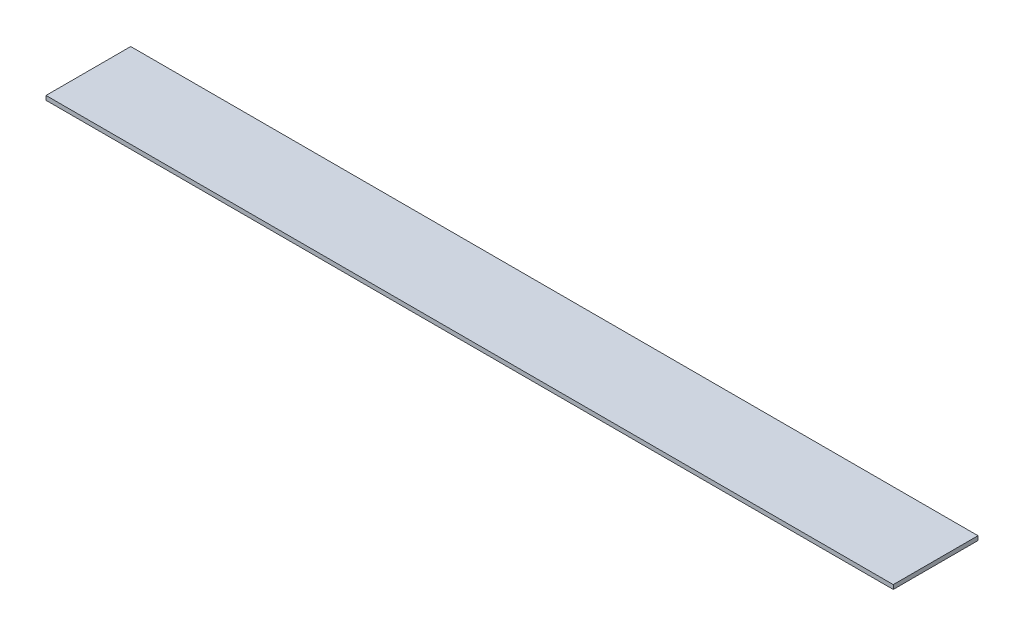
ISO-10303-21;
HEADER;
FILE_DESCRIPTION(('STEP AP214'),'2;1');
FILE_NAME('part.step','',(''),(''),'','','');
FILE_SCHEMA(('AUTOMOTIVE_DESIGN { 1 0 10303 214 1 1 1 1 }'));
ENDSEC;
DATA;
#1=APPLICATION_CONTEXT('core data for automotive mechanical design processes');
#2=APPLICATION_PROTOCOL_DEFINITION('international standard','automotive_design',2000,#1);
#3=PRODUCT_CONTEXT('',#1,'mechanical');
#4=PRODUCT('Part','Part','',(#3));
#5=PRODUCT_RELATED_PRODUCT_CATEGORY('part','',(#4));
#6=PRODUCT_DEFINITION_FORMATION('','',#4);
#7=PRODUCT_DEFINITION_CONTEXT('part definition',#1,'design');
#8=PRODUCT_DEFINITION('design','',#6,#7);
#9=PRODUCT_DEFINITION_SHAPE('','',#8);
#10=(LENGTH_UNIT() NAMED_UNIT(*) SI_UNIT(.MILLI.,.METRE.));
#11=(NAMED_UNIT(*) PLANE_ANGLE_UNIT() SI_UNIT($,.RADIAN.));
#12=(NAMED_UNIT(*) SI_UNIT($,.STERADIAN.) SOLID_ANGLE_UNIT());
#13=UNCERTAINTY_MEASURE_WITH_UNIT(LENGTH_MEASURE(1.E-05),#10,'distance_accuracy_value','');
#14=(GEOMETRIC_REPRESENTATION_CONTEXT(3) GLOBAL_UNCERTAINTY_ASSIGNED_CONTEXT((#13)) GLOBAL_UNIT_ASSIGNED_CONTEXT((#10,
#11,#12)) REPRESENTATION_CONTEXT('',''));
#15=CARTESIAN_POINT('',(0.,0.,0.));
#16=DIRECTION('',(0.,0.,1.));
#17=DIRECTION('',(1.,0.,0.));
#18=AXIS2_PLACEMENT_3D('',#15,#16,#17);
#19=CARTESIAN_POINT('',(999.999999999999,10.,-100.));
#20=DIRECTION('',(-1.,0.,0.));
#21=DIRECTION('',(0.,0.,1.));
#22=AXIS2_PLACEMENT_3D('',#19,#20,#21);
#23=PLANE('',#22);
#24=DIRECTION('',(0.,0.,-1.));
#25=VECTOR('',#24,1.);
#26=CARTESIAN_POINT('',(999.999999999999,0.,-100.));
#27=LINE('',#26,#25);
#28=CARTESIAN_POINT('',(999.999999999999,0.,100.));
#29=VERTEX_POINT('',#28);
#30=CARTESIAN_POINT('',(999.999999999999,0.,-100.));
#31=VERTEX_POINT('',#30);
#32=EDGE_CURVE('E97',#29,#31,#27,.T.);
#33=ORIENTED_EDGE('',*,*,#32,.T.);
#34=DIRECTION('',(0.,-1.,0.));
#35=VECTOR('',#34,1.);
#36=CARTESIAN_POINT('',(999.999999999999,10.,-100.));
#37=LINE('',#36,#35);
#38=CARTESIAN_POINT('',(999.999999999999,10.,-100.));
#39=VERTEX_POINT('',#38);
#40=EDGE_CURVE('E11',#39,#31,#37,.T.);
#41=ORIENTED_EDGE('',*,*,#40,.F.);
#42=DIRECTION('',(0.,0.,-1.));
#43=VECTOR('',#42,1.);
#44=CARTESIAN_POINT('',(999.999999999999,10.,-100.));
#45=LINE('',#44,#43);
#46=CARTESIAN_POINT('',(999.999999999999,10.,100.));
#47=VERTEX_POINT('',#46);
#48=EDGE_CURVE('E85',#47,#39,#45,.T.);
#49=ORIENTED_EDGE('',*,*,#48,.F.);
#50=DIRECTION('',(0.,-1.,0.));
#51=VECTOR('',#50,1.);
#52=CARTESIAN_POINT('',(999.999999999999,10.,100.));
#53=LINE('',#52,#51);
#54=EDGE_CURVE('E93',#47,#29,#53,.T.);
#55=ORIENTED_EDGE('',*,*,#54,.T.);
#56=EDGE_LOOP('',(#33,#41,#49,#55));
#57=FACE_BOUND('',#56,.T.);
#58=ADVANCED_FACE('F34',(#57),#23,.F.);
#59=CARTESIAN_POINT('',(-1000.,10.,-100.));
#60=DIRECTION('',(0.,0.,1.));
#61=DIRECTION('',(1.,0.,0.));
#62=AXIS2_PLACEMENT_3D('',#59,#60,#61);
#63=PLANE('',#62);
#64=DIRECTION('',(-1.,0.,0.));
#65=VECTOR('',#64,1.);
#66=CARTESIAN_POINT('',(-1000.,0.,-100.));
#67=LINE('',#66,#65);
#68=CARTESIAN_POINT('',(-1000.,0.,-100.));
#69=VERTEX_POINT('',#68);
#70=EDGE_CURVE('E89',#31,#69,#67,.T.);
#71=ORIENTED_EDGE('',*,*,#70,.T.);
#72=DIRECTION('',(0.,-1.,0.));
#73=VECTOR('',#72,1.);
#74=CARTESIAN_POINT('',(-1000.,10.,-100.));
#75=LINE('',#74,#73);
#76=CARTESIAN_POINT('',(-1000.,10.,-100.));
#77=VERTEX_POINT('',#76);
#78=EDGE_CURVE('E42',#77,#69,#75,.T.);
#79=ORIENTED_EDGE('',*,*,#78,.F.);
#80=DIRECTION('',(-1.,0.,0.));
#81=VECTOR('',#80,1.);
#82=CARTESIAN_POINT('',(-1000.,10.,-100.));
#83=LINE('',#82,#81);
#84=EDGE_CURVE('E80',#39,#77,#83,.T.);
#85=ORIENTED_EDGE('',*,*,#84,.F.);
#86=ORIENTED_EDGE('',*,*,#40,.T.);
#87=EDGE_LOOP('',(#71,#79,#85,#86));
#88=FACE_BOUND('',#87,.T.);
#89=ADVANCED_FACE('F88',(#88),#63,.F.);
#90=CARTESIAN_POINT('',(-1000.,10.,-100.));
#91=DIRECTION('',(1.,0.,0.));
#92=DIRECTION('',(0.,0.,-1.));
#93=AXIS2_PLACEMENT_3D('',#90,#91,#92);
#94=PLANE('',#93);
#95=DIRECTION('',(0.,0.,1.));
#96=VECTOR('',#95,1.);
#97=CARTESIAN_POINT('',(-1000.,0.,-100.));
#98=LINE('',#97,#96);
#99=CARTESIAN_POINT('',(-1000.,0.,100.));
#100=VERTEX_POINT('',#99);
#101=EDGE_CURVE('E67',#69,#100,#98,.T.);
#102=ORIENTED_EDGE('',*,*,#101,.T.);
#103=DIRECTION('',(0.,-1.,0.));
#104=VECTOR('',#103,1.);
#105=CARTESIAN_POINT('',(-1000.,10.,100.));
#106=LINE('',#105,#104);
#107=CARTESIAN_POINT('',(-1000.,10.,100.));
#108=VERTEX_POINT('',#107);
#109=EDGE_CURVE('E90',#108,#100,#106,.T.);
#110=ORIENTED_EDGE('',*,*,#109,.F.);
#111=DIRECTION('',(0.,0.,1.));
#112=VECTOR('',#111,1.);
#113=CARTESIAN_POINT('',(-1000.,10.,-100.));
#114=LINE('',#113,#112);
#115=EDGE_CURVE('E83',#77,#108,#114,.T.);
#116=ORIENTED_EDGE('',*,*,#115,.F.);
#117=ORIENTED_EDGE('',*,*,#78,.T.);
#118=EDGE_LOOP('',(#102,#110,#116,#117));
#119=FACE_BOUND('',#118,.T.);
#120=ADVANCED_FACE('F91',(#119),#94,.F.);
#121=CARTESIAN_POINT('',(-1000.,10.,100.));
#122=DIRECTION('',(0.,0.,-1.));
#123=DIRECTION('',(-1.,0.,0.));
#124=AXIS2_PLACEMENT_3D('',#121,#122,#123);
#125=PLANE('',#124);
#126=DIRECTION('',(1.,0.,0.));
#127=VECTOR('',#126,1.);
#128=CARTESIAN_POINT('',(-1000.,0.,100.));
#129=LINE('',#128,#127);
#130=EDGE_CURVE('E73',#100,#29,#129,.T.);
#131=ORIENTED_EDGE('',*,*,#130,.T.);
#132=ORIENTED_EDGE('',*,*,#54,.F.);
#133=DIRECTION('',(1.,0.,0.));
#134=VECTOR('',#133,1.);
#135=CARTESIAN_POINT('',(-1000.,10.,100.));
#136=LINE('',#135,#134);
#137=EDGE_CURVE('E50',#108,#47,#136,.T.);
#138=ORIENTED_EDGE('',*,*,#137,.F.);
#139=ORIENTED_EDGE('',*,*,#109,.T.);
#140=EDGE_LOOP('',(#131,#132,#138,#139));
#141=FACE_BOUND('',#140,.T.);
#142=ADVANCED_FACE('F104',(#141),#125,.F.);
#143=CARTESIAN_POINT('',(0.,10.,0.));
#144=DIRECTION('',(0.,1.,0.));
#145=DIRECTION('',(0.,0.,1.));
#146=AXIS2_PLACEMENT_3D('',#143,#144,#145);
#147=PLANE('',#146);
#148=ORIENTED_EDGE('',*,*,#48,.T.);
#149=ORIENTED_EDGE('',*,*,#84,.T.);
#150=ORIENTED_EDGE('',*,*,#115,.T.);
#151=ORIENTED_EDGE('',*,*,#137,.T.);
#152=EDGE_LOOP('',(#148,#149,#150,#151));
#153=FACE_BOUND('',#152,.T.);
#154=ADVANCED_FACE('F81',(#153),#147,.T.);
#155=CARTESIAN_POINT('',(0.,0.,0.));
#156=DIRECTION('',(0.,1.,0.));
#157=DIRECTION('',(0.,0.,1.));
#158=AXIS2_PLACEMENT_3D('',#155,#156,#157);
#159=PLANE('',#158);
#160=ORIENTED_EDGE('',*,*,#32,.F.);
#161=ORIENTED_EDGE('',*,*,#130,.F.);
#162=ORIENTED_EDGE('',*,*,#101,.F.);
#163=ORIENTED_EDGE('',*,*,#70,.F.);
#164=EDGE_LOOP('',(#160,#161,#162,#163));
#165=FACE_BOUND('',#164,.T.);
#166=ADVANCED_FACE('F107',(#165),#159,.F.);
#167=CLOSED_SHELL('',(#58,#89,#120,#142,#154,#166));
#168=MANIFOLD_SOLID_BREP('B2',#167);
#169=ADVANCED_BREP_SHAPE_REPRESENTATION('',(#18,#168),#14);
#170=SHAPE_DEFINITION_REPRESENTATION(#9,#169);
ENDSEC;
END-ISO-10303-21;
